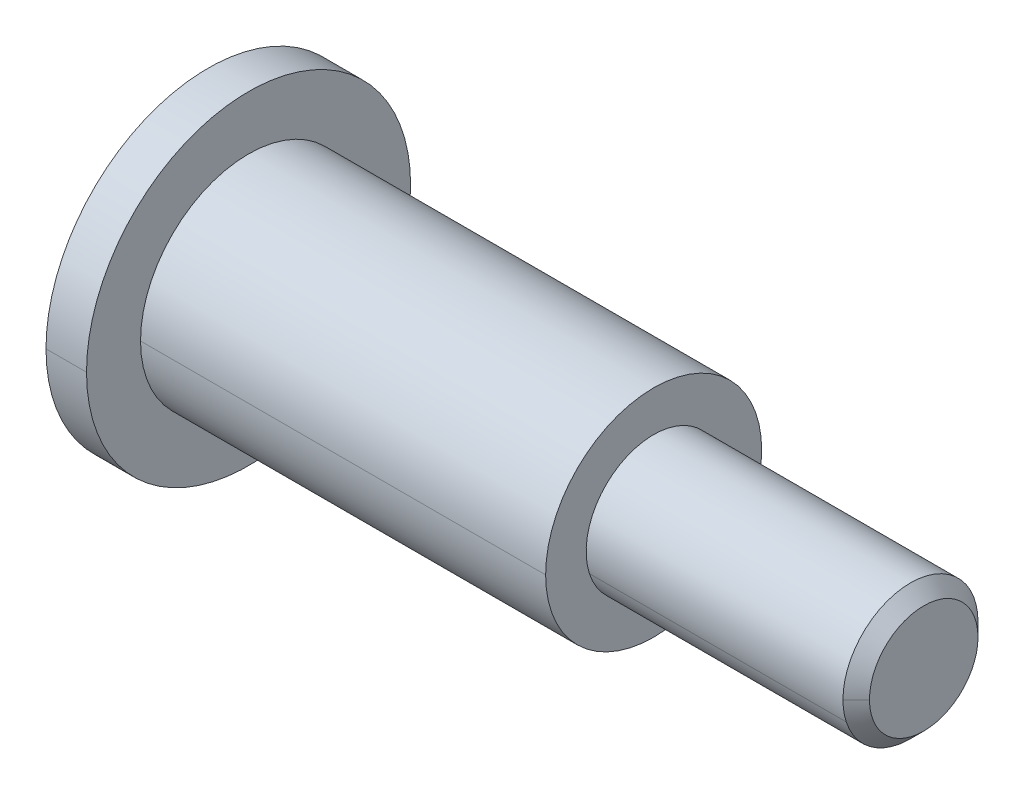
ISO-10303-21;
HEADER;
FILE_DESCRIPTION(('STEP AP214'),'2;1');
FILE_NAME('part.step','',(''),(''),'','','');
FILE_SCHEMA(('AUTOMOTIVE_DESIGN { 1 0 10303 214 1 1 1 1 }'));
ENDSEC;
DATA;
#1=APPLICATION_CONTEXT('core data for automotive mechanical design processes');
#2=APPLICATION_PROTOCOL_DEFINITION('international standard','automotive_design',2000,#1);
#3=PRODUCT_CONTEXT('',#1,'mechanical');
#4=PRODUCT('Part','Part','',(#3));
#5=PRODUCT_RELATED_PRODUCT_CATEGORY('part','',(#4));
#6=PRODUCT_DEFINITION_FORMATION('','',#4);
#7=PRODUCT_DEFINITION_CONTEXT('part definition',#1,'design');
#8=PRODUCT_DEFINITION('design','',#6,#7);
#9=PRODUCT_DEFINITION_SHAPE('','',#8);
#10=(LENGTH_UNIT() NAMED_UNIT(*) SI_UNIT(.MILLI.,.METRE.));
#11=(NAMED_UNIT(*) PLANE_ANGLE_UNIT() SI_UNIT($,.RADIAN.));
#12=(NAMED_UNIT(*) SI_UNIT($,.STERADIAN.) SOLID_ANGLE_UNIT());
#13=UNCERTAINTY_MEASURE_WITH_UNIT(LENGTH_MEASURE(1.E-05),#10,'distance_accuracy_value','');
#14=(GEOMETRIC_REPRESENTATION_CONTEXT(3) GLOBAL_UNCERTAINTY_ASSIGNED_CONTEXT((#13)) GLOBAL_UNIT_ASSIGNED_CONTEXT((#10,
#11,#12)) REPRESENTATION_CONTEXT('',''));
#15=CARTESIAN_POINT('',(0.,0.,0.));
#16=DIRECTION('',(0.,0.,1.));
#17=DIRECTION('',(1.,0.,0.));
#18=AXIS2_PLACEMENT_3D('',#15,#16,#17);
#19=CARTESIAN_POINT('',(-1.5,0.,0.));
#20=DIRECTION('',(1.,0.,0.));
#21=DIRECTION('',(0.,0.,-1.));
#22=AXIS2_PLACEMENT_3D('',#19,#20,#21);
#23=PLANE('',#22);
#24=CARTESIAN_POINT('',(-1.5,0.,0.));
#25=DIRECTION('',(1.,0.,0.));
#26=DIRECTION('',(0.,0.,-1.));
#27=AXIS2_PLACEMENT_3D('',#24,#25,#26);
#28=CIRCLE('',#27,6.);
#29=CARTESIAN_POINT('',(-1.5,0.,6.));
#30=VERTEX_POINT('',#29);
#31=CARTESIAN_POINT('',(-1.5,0.,-6.));
#32=VERTEX_POINT('',#31);
#33=EDGE_CURVE('E10',#30,#32,#28,.T.);
#34=ORIENTED_EDGE('',*,*,#33,.F.);
#35=CARTESIAN_POINT('',(-1.5,0.,0.));
#36=DIRECTION('',(1.,0.,0.));
#37=DIRECTION('',(0.,0.,-1.));
#38=AXIS2_PLACEMENT_3D('',#35,#36,#37);
#39=CIRCLE('',#38,6.);
#40=EDGE_CURVE('E23',#32,#30,#39,.T.);
#41=ORIENTED_EDGE('',*,*,#40,.F.);
#42=EDGE_LOOP('',(#34,#41));
#43=FACE_BOUND('',#42,.T.);
#44=DIRECTION('',(0.,0.500000000000009,-0.866025403784433));
#45=VECTOR('',#44,1.);
#46=CARTESIAN_POINT('',(-1.5,-1.7320508075689,0.));
#47=LINE('',#46,#45);
#48=CARTESIAN_POINT('',(-1.5,-1.7320508075689,0.));
#49=VERTEX_POINT('',#48);
#50=CARTESIAN_POINT('',(-1.5,-0.86602540378444,-1.5));
#51=VERTEX_POINT('',#50);
#52=EDGE_CURVE('E375',#49,#51,#47,.T.);
#53=ORIENTED_EDGE('',*,*,#52,.T.);
#54=DIRECTION('',(0.,1.,0.));
#55=VECTOR('',#54,1.);
#56=CARTESIAN_POINT('',(-1.5,-0.86602540378444,-1.5));
#57=LINE('',#56,#55);
#58=CARTESIAN_POINT('',(-1.5,0.86602540378444,-1.5));
#59=VERTEX_POINT('',#58);
#60=EDGE_CURVE('E371',#51,#59,#57,.T.);
#61=ORIENTED_EDGE('',*,*,#60,.T.);
#62=DIRECTION('',(0.,0.500000000000009,0.866025403784433));
#63=VECTOR('',#62,1.);
#64=CARTESIAN_POINT('',(-1.5,0.86602540378444,-1.5));
#65=LINE('',#64,#63);
#66=CARTESIAN_POINT('',(-1.5,1.7320508075689,0.));
#67=VERTEX_POINT('',#66);
#68=EDGE_CURVE('E367',#59,#67,#65,.T.);
#69=ORIENTED_EDGE('',*,*,#68,.T.);
#70=DIRECTION('',(0.,-0.500000000000009,0.866025403784433));
#71=VECTOR('',#70,1.);
#72=CARTESIAN_POINT('',(-1.5,1.7320508075689,0.));
#73=LINE('',#72,#71);
#74=CARTESIAN_POINT('',(-1.5,0.86602540378444,1.5));
#75=VERTEX_POINT('',#74);
#76=EDGE_CURVE('E363',#67,#75,#73,.T.);
#77=ORIENTED_EDGE('',*,*,#76,.T.);
#78=DIRECTION('',(0.,-1.,0.));
#79=VECTOR('',#78,1.);
#80=CARTESIAN_POINT('',(-1.5,0.86602540378444,1.5));
#81=LINE('',#80,#79);
#82=CARTESIAN_POINT('',(-1.5,-0.86602540378444,1.5));
#83=VERTEX_POINT('',#82);
#84=EDGE_CURVE('E359',#75,#83,#81,.T.);
#85=ORIENTED_EDGE('',*,*,#84,.T.);
#86=DIRECTION('',(0.,-0.500000000000009,-0.866025403784433));
#87=VECTOR('',#86,1.);
#88=CARTESIAN_POINT('',(-1.5,-0.86602540378444,1.5));
#89=LINE('',#88,#87);
#90=EDGE_CURVE('E355',#83,#49,#89,.T.);
#91=ORIENTED_EDGE('',*,*,#90,.T.);
#92=EDGE_LOOP('',(#53,#61,#69,#77,#85,#91));
#93=FACE_BOUND('',#92,.T.);
#94=ADVANCED_FACE('F15',(#43,#93),#23,.F.);
#95=CARTESIAN_POINT('',(1.5,-0.86602540378444,1.5));
#96=DIRECTION('',(0.,0.866025403784433,-0.500000000000009));
#97=DIRECTION('',(0.,0.500000000000009,0.866025403784433));
#98=AXIS2_PLACEMENT_3D('',#95,#96,#97);
#99=PLANE('',#98);
#100=ORIENTED_EDGE('',*,*,#90,.F.);
#101=DIRECTION('',(-1.,0.,0.));
#102=VECTOR('',#101,1.);
#103=CARTESIAN_POINT('',(1.5,-0.86602540378444,1.5));
#104=LINE('',#103,#102);
#105=CARTESIAN_POINT('',(1.5,-0.86602540378444,1.5));
#106=VERTEX_POINT('',#105);
#107=EDGE_CURVE('E350',#106,#83,#104,.T.);
#108=ORIENTED_EDGE('',*,*,#107,.F.);
#109=DIRECTION('',(0.,-0.500000000000009,-0.866025403784433));
#110=VECTOR('',#109,1.);
#111=CARTESIAN_POINT('',(1.5,-0.86602540378444,1.5));
#112=LINE('',#111,#110);
#113=CARTESIAN_POINT('',(1.5,-1.29903810567666,0.750000000000019));
#114=VERTEX_POINT('',#113);
#115=EDGE_CURVE('E346',#106,#114,#112,.T.);
#116=ORIENTED_EDGE('',*,*,#115,.T.);
#117=DIRECTION('',(0.,-0.500000000000009,-0.866025403784433));
#118=VECTOR('',#117,1.);
#119=CARTESIAN_POINT('',(1.5,-0.86602540378444,1.5));
#120=LINE('',#119,#118);
#121=CARTESIAN_POINT('',(1.5,-1.7320508075689,0.));
#122=VERTEX_POINT('',#121);
#123=EDGE_CURVE('E342',#114,#122,#120,.T.);
#124=ORIENTED_EDGE('',*,*,#123,.T.);
#125=DIRECTION('',(-1.,0.,0.));
#126=VECTOR('',#125,1.);
#127=CARTESIAN_POINT('',(1.5,-1.7320508075689,0.));
#128=LINE('',#127,#126);
#129=EDGE_CURVE('E337',#122,#49,#128,.T.);
#130=ORIENTED_EDGE('',*,*,#129,.T.);
#131=EDGE_LOOP('',(#100,#108,#116,#124,#130));
#132=FACE_BOUND('',#131,.T.);
#133=ADVANCED_FACE('F404',(#132),#99,.T.);
#134=CARTESIAN_POINT('',(1.5,-1.7320508075689,0.));
#135=DIRECTION('',(0.,0.866025403784433,0.500000000000009));
#136=DIRECTION('',(0.,-0.500000000000009,0.866025403784433));
#137=AXIS2_PLACEMENT_3D('',#134,#135,#136);
#138=PLANE('',#137);
#139=ORIENTED_EDGE('',*,*,#52,.F.);
#140=ORIENTED_EDGE('',*,*,#129,.F.);
#141=DIRECTION('',(0.,0.500000000000009,-0.866025403784433));
#142=VECTOR('',#141,1.);
#143=CARTESIAN_POINT('',(1.5,-1.7320508075689,0.));
#144=LINE('',#143,#142);
#145=CARTESIAN_POINT('',(1.5,-1.29903810567665,-0.750000000000014));
#146=VERTEX_POINT('',#145);
#147=EDGE_CURVE('E333',#122,#146,#144,.T.);
#148=ORIENTED_EDGE('',*,*,#147,.T.);
#149=DIRECTION('',(0.,0.500000000000009,-0.866025403784433));
#150=VECTOR('',#149,1.);
#151=CARTESIAN_POINT('',(1.5,-1.7320508075689,0.));
#152=LINE('',#151,#150);
#153=CARTESIAN_POINT('',(1.5,-0.86602540378444,-1.5));
#154=VERTEX_POINT('',#153);
#155=EDGE_CURVE('E329',#146,#154,#152,.T.);
#156=ORIENTED_EDGE('',*,*,#155,.T.);
#157=DIRECTION('',(-1.,0.,0.));
#158=VECTOR('',#157,1.);
#159=CARTESIAN_POINT('',(1.5,-0.86602540378444,-1.5));
#160=LINE('',#159,#158);
#161=EDGE_CURVE('E324',#154,#51,#160,.T.);
#162=ORIENTED_EDGE('',*,*,#161,.T.);
#163=EDGE_LOOP('',(#139,#140,#148,#156,#162));
#164=FACE_BOUND('',#163,.T.);
#165=ADVANCED_FACE('F408',(#164),#138,.T.);
#166=CARTESIAN_POINT('',(1.5,-0.86602540378444,-1.5));
#167=DIRECTION('',(0.,0.,1.));
#168=DIRECTION('',(1.,0.,0.));
#169=AXIS2_PLACEMENT_3D('',#166,#167,#168);
#170=PLANE('',#169);
#171=ORIENTED_EDGE('',*,*,#60,.F.);
#172=ORIENTED_EDGE('',*,*,#161,.F.);
#173=DIRECTION('',(0.,1.,0.));
#174=VECTOR('',#173,1.);
#175=CARTESIAN_POINT('',(1.5,-0.86602540378444,-1.5));
#176=LINE('',#175,#174);
#177=CARTESIAN_POINT('',(1.5,0.,-1.5));
#178=VERTEX_POINT('',#177);
#179=EDGE_CURVE('E320',#154,#178,#176,.T.);
#180=ORIENTED_EDGE('',*,*,#179,.T.);
#181=DIRECTION('',(0.,1.,0.));
#182=VECTOR('',#181,1.);
#183=CARTESIAN_POINT('',(1.5,-0.86602540378444,-1.5));
#184=LINE('',#183,#182);
#185=CARTESIAN_POINT('',(1.5,0.86602540378444,-1.5));
#186=VERTEX_POINT('',#185);
#187=EDGE_CURVE('E316',#178,#186,#184,.T.);
#188=ORIENTED_EDGE('',*,*,#187,.T.);
#189=DIRECTION('',(-1.,0.,0.));
#190=VECTOR('',#189,1.);
#191=CARTESIAN_POINT('',(1.5,0.86602540378444,-1.5));
#192=LINE('',#191,#190);
#193=EDGE_CURVE('E311',#186,#59,#192,.T.);
#194=ORIENTED_EDGE('',*,*,#193,.T.);
#195=EDGE_LOOP('',(#171,#172,#180,#188,#194));
#196=FACE_BOUND('',#195,.T.);
#197=ADVANCED_FACE('F420',(#196),#170,.T.);
#198=CARTESIAN_POINT('',(1.5,0.86602540378444,-1.5));
#199=DIRECTION('',(0.,-0.866025403784433,0.500000000000009));
#200=DIRECTION('',(0.,-0.500000000000009,-0.866025403784433));
#201=AXIS2_PLACEMENT_3D('',#198,#199,#200);
#202=PLANE('',#201);
#203=ORIENTED_EDGE('',*,*,#68,.F.);
#204=ORIENTED_EDGE('',*,*,#193,.F.);
#205=DIRECTION('',(0.,0.500000000000009,0.866025403784433));
#206=VECTOR('',#205,1.);
#207=CARTESIAN_POINT('',(1.5,0.86602540378444,-1.5));
#208=LINE('',#207,#206);
#209=CARTESIAN_POINT('',(1.5,1.29903810567666,-0.750000000000019));
#210=VERTEX_POINT('',#209);
#211=EDGE_CURVE('E307',#186,#210,#208,.T.);
#212=ORIENTED_EDGE('',*,*,#211,.T.);
#213=DIRECTION('',(0.,0.500000000000009,0.866025403784433));
#214=VECTOR('',#213,1.);
#215=CARTESIAN_POINT('',(1.5,0.86602540378444,-1.5));
#216=LINE('',#215,#214);
#217=CARTESIAN_POINT('',(1.5,1.7320508075689,0.));
#218=VERTEX_POINT('',#217);
#219=EDGE_CURVE('E303',#210,#218,#216,.T.);
#220=ORIENTED_EDGE('',*,*,#219,.T.);
#221=DIRECTION('',(-1.,0.,0.));
#222=VECTOR('',#221,1.);
#223=CARTESIAN_POINT('',(1.5,1.7320508075689,0.));
#224=LINE('',#223,#222);
#225=EDGE_CURVE('E298',#218,#67,#224,.T.);
#226=ORIENTED_EDGE('',*,*,#225,.T.);
#227=EDGE_LOOP('',(#203,#204,#212,#220,#226));
#228=FACE_BOUND('',#227,.T.);
#229=ADVANCED_FACE('F426',(#228),#202,.T.);
#230=CARTESIAN_POINT('',(1.5,1.7320508075689,0.));
#231=DIRECTION('',(0.,-0.866025403784433,-0.500000000000009));
#232=DIRECTION('',(0.,0.500000000000009,-0.866025403784433));
#233=AXIS2_PLACEMENT_3D('',#230,#231,#232);
#234=PLANE('',#233);
#235=ORIENTED_EDGE('',*,*,#76,.F.);
#236=ORIENTED_EDGE('',*,*,#225,.F.);
#237=DIRECTION('',(0.,-0.500000000000009,0.866025403784433));
#238=VECTOR('',#237,1.);
#239=CARTESIAN_POINT('',(1.5,1.7320508075689,0.));
#240=LINE('',#239,#238);
#241=CARTESIAN_POINT('',(1.5,1.29903810567666,0.750000000000019));
#242=VERTEX_POINT('',#241);
#243=EDGE_CURVE('E294',#218,#242,#240,.T.);
#244=ORIENTED_EDGE('',*,*,#243,.T.);
#245=DIRECTION('',(0.,-0.500000000000009,0.866025403784433));
#246=VECTOR('',#245,1.);
#247=CARTESIAN_POINT('',(1.5,1.7320508075689,0.));
#248=LINE('',#247,#246);
#249=CARTESIAN_POINT('',(1.5,0.86602540378444,1.5));
#250=VERTEX_POINT('',#249);
#251=EDGE_CURVE('E290',#242,#250,#248,.T.);
#252=ORIENTED_EDGE('',*,*,#251,.T.);
#253=DIRECTION('',(-1.,0.,0.));
#254=VECTOR('',#253,1.);
#255=CARTESIAN_POINT('',(1.5,0.86602540378444,1.5));
#256=LINE('',#255,#254);
#257=EDGE_CURVE('E285',#250,#75,#256,.T.);
#258=ORIENTED_EDGE('',*,*,#257,.T.);
#259=EDGE_LOOP('',(#235,#236,#244,#252,#258));
#260=FACE_BOUND('',#259,.T.);
#261=ADVANCED_FACE('F432',(#260),#234,.T.);
#262=CARTESIAN_POINT('',(1.5,0.86602540378444,1.5));
#263=DIRECTION('',(0.,0.,-1.));
#264=DIRECTION('',(-1.,0.,0.));
#265=AXIS2_PLACEMENT_3D('',#262,#263,#264);
#266=PLANE('',#265);
#267=ORIENTED_EDGE('',*,*,#84,.F.);
#268=ORIENTED_EDGE('',*,*,#257,.F.);
#269=DIRECTION('',(0.,-1.,0.));
#270=VECTOR('',#269,1.);
#271=CARTESIAN_POINT('',(1.5,0.86602540378444,1.5));
#272=LINE('',#271,#270);
#273=CARTESIAN_POINT('',(1.5,0.,1.5));
#274=VERTEX_POINT('',#273);
#275=EDGE_CURVE('E281',#250,#274,#272,.T.);
#276=ORIENTED_EDGE('',*,*,#275,.T.);
#277=DIRECTION('',(0.,-1.,0.));
#278=VECTOR('',#277,1.);
#279=CARTESIAN_POINT('',(1.5,0.86602540378444,1.5));
#280=LINE('',#279,#278);
#281=EDGE_CURVE('E276',#274,#106,#280,.T.);
#282=ORIENTED_EDGE('',*,*,#281,.T.);
#283=ORIENTED_EDGE('',*,*,#107,.T.);
#284=EDGE_LOOP('',(#267,#268,#276,#282,#283));
#285=FACE_BOUND('',#284,.T.);
#286=ADVANCED_FACE('F436',(#285),#266,.T.);
#287=CARTESIAN_POINT('',(1.5,0.,0.));
#288=DIRECTION('',(1.,0.,0.));
#289=DIRECTION('',(0.,0.,-1.));
#290=AXIS2_PLACEMENT_3D('',#287,#288,#289);
#291=PLANE('',#290);
#292=CARTESIAN_POINT('',(1.5,0.,0.));
#293=DIRECTION('',(1.,0.,0.));
#294=DIRECTION('',(0.,0.,-1.));
#295=AXIS2_PLACEMENT_3D('',#292,#293,#294);
#296=CIRCLE('',#295,1.5);
#297=EDGE_CURVE('E271',#274,#114,#296,.T.);
#298=ORIENTED_EDGE('',*,*,#297,.T.);
#299=ORIENTED_EDGE('',*,*,#115,.F.);
#300=ORIENTED_EDGE('',*,*,#281,.F.);
#301=EDGE_LOOP('',(#298,#299,#300));
#302=FACE_BOUND('',#301,.T.);
#303=ADVANCED_FACE('F477',(#302),#291,.F.);
#304=CARTESIAN_POINT('',(1.5,0.,0.));
#305=DIRECTION('',(-1.,0.,0.));
#306=DIRECTION('',(0.,1.,0.));
#307=AXIS2_PLACEMENT_3D('',#304,#305,#306);
#308=CONICAL_SURFACE('',#307,1.5,1.04719755119662);
#309=DIRECTION('',(-0.499999999999983,0.,-0.866025403784448));
#310=VECTOR('',#309,1.);
#311=CARTESIAN_POINT('',(2.3660254037844,0.,0.));
#312=LINE('',#311,#310);
#313=CARTESIAN_POINT('',(2.3660254037844,0.,0.));
#314=VERTEX_POINT('',#313);
#315=EDGE_CURVE('E266',#314,#178,#312,.T.);
#316=ORIENTED_EDGE('',*,*,#315,.T.);
#317=CARTESIAN_POINT('',(1.5,0.,0.));
#318=DIRECTION('',(1.,0.,0.));
#319=DIRECTION('',(0.,0.,-1.));
#320=AXIS2_PLACEMENT_3D('',#317,#318,#319);
#321=CIRCLE('',#320,1.5);
#322=EDGE_CURVE('E261',#146,#178,#321,.T.);
#323=ORIENTED_EDGE('',*,*,#322,.F.);
#324=CARTESIAN_POINT('',(1.5,0.,0.));
#325=DIRECTION('',(1.,0.,0.));
#326=DIRECTION('',(0.,0.,-1.));
#327=AXIS2_PLACEMENT_3D('',#324,#325,#326);
#328=CIRCLE('',#327,1.5);
#329=EDGE_CURVE('E256',#114,#146,#328,.T.);
#330=ORIENTED_EDGE('',*,*,#329,.F.);
#331=ORIENTED_EDGE('',*,*,#297,.F.);
#332=DIRECTION('',(-0.499999999999983,0.,0.866025403784448));
#333=VECTOR('',#332,1.);
#334=CARTESIAN_POINT('',(2.3660254037844,0.,0.));
#335=LINE('',#334,#333);
#336=EDGE_CURVE('E251',#314,#274,#335,.T.);
#337=ORIENTED_EDGE('',*,*,#336,.F.);
#338=EDGE_LOOP('',(#316,#323,#330,#331,#337));
#339=FACE_BOUND('',#338,.T.);
#340=ADVANCED_FACE('F445',(#339),#308,.F.);
#341=CARTESIAN_POINT('',(1.5,0.,0.));
#342=DIRECTION('',(-1.,0.,0.));
#343=DIRECTION('',(0.,-1.,0.));
#344=AXIS2_PLACEMENT_3D('',#341,#342,#343);
#345=CONICAL_SURFACE('',#344,1.5,1.04719755119662);
#346=ORIENTED_EDGE('',*,*,#336,.T.);
#347=CARTESIAN_POINT('',(1.5,0.,0.));
#348=DIRECTION('',(1.,0.,0.));
#349=DIRECTION('',(0.,0.,-1.));
#350=AXIS2_PLACEMENT_3D('',#347,#348,#349);
#351=CIRCLE('',#350,1.5);
#352=EDGE_CURVE('E246',#242,#274,#351,.T.);
#353=ORIENTED_EDGE('',*,*,#352,.F.);
#354=CARTESIAN_POINT('',(1.5,0.,0.));
#355=DIRECTION('',(1.,0.,0.));
#356=DIRECTION('',(0.,0.,-1.));
#357=AXIS2_PLACEMENT_3D('',#354,#355,#356);
#358=CIRCLE('',#357,1.5);
#359=EDGE_CURVE('E241',#210,#242,#358,.T.);
#360=ORIENTED_EDGE('',*,*,#359,.F.);
#361=CARTESIAN_POINT('',(1.5,0.,0.));
#362=DIRECTION('',(1.,0.,0.));
#363=DIRECTION('',(0.,0.,-1.));
#364=AXIS2_PLACEMENT_3D('',#361,#362,#363);
#365=CIRCLE('',#364,1.5);
#366=EDGE_CURVE('E236',#178,#210,#365,.T.);
#367=ORIENTED_EDGE('',*,*,#366,.F.);
#368=ORIENTED_EDGE('',*,*,#315,.F.);
#369=EDGE_LOOP('',(#346,#353,#360,#367,#368));
#370=FACE_BOUND('',#369,.T.);
#371=ADVANCED_FACE('F470',(#370),#345,.F.);
#372=CARTESIAN_POINT('',(1.5,0.,0.));
#373=DIRECTION('',(1.,0.,0.));
#374=DIRECTION('',(0.,0.,-1.));
#375=AXIS2_PLACEMENT_3D('',#372,#373,#374);
#376=PLANE('',#375);
#377=ORIENTED_EDGE('',*,*,#366,.T.);
#378=ORIENTED_EDGE('',*,*,#211,.F.);
#379=ORIENTED_EDGE('',*,*,#187,.F.);
#380=EDGE_LOOP('',(#377,#378,#379));
#381=FACE_BOUND('',#380,.T.);
#382=ADVANCED_FACE('F466',(#381),#376,.F.);
#383=CARTESIAN_POINT('',(1.5,0.,0.));
#384=DIRECTION('',(1.,0.,0.));
#385=DIRECTION('',(0.,0.,-1.));
#386=AXIS2_PLACEMENT_3D('',#383,#384,#385);
#387=PLANE('',#386);
#388=ORIENTED_EDGE('',*,*,#219,.F.);
#389=ORIENTED_EDGE('',*,*,#359,.T.);
#390=ORIENTED_EDGE('',*,*,#243,.F.);
#391=EDGE_LOOP('',(#388,#389,#390));
#392=FACE_BOUND('',#391,.T.);
#393=ADVANCED_FACE('F459',(#392),#387,.F.);
#394=CARTESIAN_POINT('',(1.5,0.,0.));
#395=DIRECTION('',(1.,0.,0.));
#396=DIRECTION('',(0.,0.,-1.));
#397=AXIS2_PLACEMENT_3D('',#394,#395,#396);
#398=PLANE('',#397);
#399=ORIENTED_EDGE('',*,*,#352,.T.);
#400=ORIENTED_EDGE('',*,*,#275,.F.);
#401=ORIENTED_EDGE('',*,*,#251,.F.);
#402=EDGE_LOOP('',(#399,#400,#401));
#403=FACE_BOUND('',#402,.T.);
#404=ADVANCED_FACE('F452',(#403),#398,.F.);
#405=CARTESIAN_POINT('',(1.5,0.,0.));
#406=DIRECTION('',(1.,0.,0.));
#407=DIRECTION('',(0.,0.,-1.));
#408=AXIS2_PLACEMENT_3D('',#405,#406,#407);
#409=PLANE('',#408);
#410=ORIENTED_EDGE('',*,*,#329,.T.);
#411=ORIENTED_EDGE('',*,*,#147,.F.);
#412=ORIENTED_EDGE('',*,*,#123,.F.);
#413=EDGE_LOOP('',(#410,#411,#412));
#414=FACE_BOUND('',#413,.T.);
#415=ADVANCED_FACE('F450',(#414),#409,.F.);
#416=CARTESIAN_POINT('',(1.5,0.,0.));
#417=DIRECTION('',(1.,0.,0.));
#418=DIRECTION('',(0.,0.,-1.));
#419=AXIS2_PLACEMENT_3D('',#416,#417,#418);
#420=PLANE('',#419);
#421=ORIENTED_EDGE('',*,*,#322,.T.);
#422=ORIENTED_EDGE('',*,*,#179,.F.);
#423=ORIENTED_EDGE('',*,*,#155,.F.);
#424=EDGE_LOOP('',(#421,#422,#423));
#425=FACE_BOUND('',#424,.T.);
#426=ADVANCED_FACE('F449',(#425),#420,.F.);
#427=CARTESIAN_POINT('',(15.,0.,0.));
#428=DIRECTION('',(1.,0.,0.));
#429=DIRECTION('',(0.,-1.,0.));
#430=AXIS2_PLACEMENT_3D('',#427,#428,#429);
#431=CYLINDRICAL_SURFACE('',#430,6.);
#432=DIRECTION('',(1.,0.,0.));
#433=VECTOR('',#432,1.);
#434=CARTESIAN_POINT('',(-1.5,0.,6.));
#435=LINE('',#434,#433);
#436=CARTESIAN_POINT('',(0.,0.,6.));
#437=VERTEX_POINT('',#436);
#438=EDGE_CURVE('E232',#30,#437,#435,.T.);
#439=ORIENTED_EDGE('',*,*,#438,.T.);
#440=CARTESIAN_POINT('',(0.,0.,0.));
#441=DIRECTION('',(1.,0.,0.));
#442=DIRECTION('',(0.,0.,-1.));
#443=AXIS2_PLACEMENT_3D('',#440,#441,#442);
#444=CIRCLE('',#443,6.);
#445=CARTESIAN_POINT('',(0.,0.,-6.));
#446=VERTEX_POINT('',#445);
#447=EDGE_CURVE('E227',#446,#437,#444,.T.);
#448=ORIENTED_EDGE('',*,*,#447,.F.);
#449=DIRECTION('',(1.,0.,0.));
#450=VECTOR('',#449,1.);
#451=CARTESIAN_POINT('',(-1.5,0.,-6.));
#452=LINE('',#451,#450);
#453=EDGE_CURVE('E222',#32,#446,#452,.T.);
#454=ORIENTED_EDGE('',*,*,#453,.F.);
#455=ORIENTED_EDGE('',*,*,#40,.T.);
#456=EDGE_LOOP('',(#439,#448,#454,#455));
#457=FACE_BOUND('',#456,.T.);
#458=ADVANCED_FACE('F384',(#457),#431,.T.);
#459=CARTESIAN_POINT('',(15.,0.,0.));
#460=DIRECTION('',(1.,0.,0.));
#461=DIRECTION('',(0.,1.,0.));
#462=AXIS2_PLACEMENT_3D('',#459,#460,#461);
#463=CYLINDRICAL_SURFACE('',#462,6.);
#464=ORIENTED_EDGE('',*,*,#438,.F.);
#465=ORIENTED_EDGE('',*,*,#33,.T.);
#466=ORIENTED_EDGE('',*,*,#453,.T.);
#467=CARTESIAN_POINT('',(0.,0.,0.));
#468=DIRECTION('',(1.,0.,0.));
#469=DIRECTION('',(0.,0.,-1.));
#470=AXIS2_PLACEMENT_3D('',#467,#468,#469);
#471=CIRCLE('',#470,6.);
#472=EDGE_CURVE('E217',#437,#446,#471,.T.);
#473=ORIENTED_EDGE('',*,*,#472,.F.);
#474=EDGE_LOOP('',(#464,#465,#466,#473));
#475=FACE_BOUND('',#474,.T.);
#476=ADVANCED_FACE('F387',(#475),#463,.T.);
#477=CARTESIAN_POINT('',(0.,6.,0.));
#478=DIRECTION('',(-1.,0.,0.));
#479=DIRECTION('',(0.,0.,1.));
#480=AXIS2_PLACEMENT_3D('',#477,#478,#479);
#481=PLANE('',#480);
#482=CARTESIAN_POINT('',(0.,0.,0.));
#483=DIRECTION('',(1.,0.,0.));
#484=DIRECTION('',(0.,0.,-1.));
#485=AXIS2_PLACEMENT_3D('',#482,#483,#484);
#486=CIRCLE('',#485,4.);
#487=CARTESIAN_POINT('',(0.,0.,4.));
#488=VERTEX_POINT('',#487);
#489=CARTESIAN_POINT('',(0.,0.,-4.));
#490=VERTEX_POINT('',#489);
#491=EDGE_CURVE('E212',#488,#490,#486,.T.);
#492=ORIENTED_EDGE('',*,*,#491,.F.);
#493=CARTESIAN_POINT('',(0.,0.,0.));
#494=DIRECTION('',(1.,0.,0.));
#495=DIRECTION('',(0.,0.,-1.));
#496=AXIS2_PLACEMENT_3D('',#493,#494,#495);
#497=CIRCLE('',#496,4.);
#498=EDGE_CURVE('E207',#490,#488,#497,.T.);
#499=ORIENTED_EDGE('',*,*,#498,.F.);
#500=EDGE_LOOP('',(#492,#499));
#501=FACE_BOUND('',#500,.T.);
#502=ORIENTED_EDGE('',*,*,#447,.T.);
#503=ORIENTED_EDGE('',*,*,#472,.T.);
#504=EDGE_LOOP('',(#502,#503));
#505=FACE_BOUND('',#504,.T.);
#506=ADVANCED_FACE('F389',(#501,#505),#481,.F.);
#507=CARTESIAN_POINT('',(15.,0.,0.));
#508=DIRECTION('',(1.,0.,0.));
#509=DIRECTION('',(0.,-1.,0.));
#510=AXIS2_PLACEMENT_3D('',#507,#508,#509);
#511=CYLINDRICAL_SURFACE('',#510,4.);
#512=DIRECTION('',(1.,0.,0.));
#513=VECTOR('',#512,1.);
#514=CARTESIAN_POINT('',(0.,0.,4.));
#515=LINE('',#514,#513);
#516=CARTESIAN_POINT('',(15.,0.,4.));
#517=VERTEX_POINT('',#516);
#518=EDGE_CURVE('E203',#488,#517,#515,.T.);
#519=ORIENTED_EDGE('',*,*,#518,.T.);
#520=CARTESIAN_POINT('',(15.,0.,0.));
#521=DIRECTION('',(1.,0.,0.));
#522=DIRECTION('',(0.,0.,-1.));
#523=AXIS2_PLACEMENT_3D('',#520,#521,#522);
#524=CIRCLE('',#523,4.);
#525=CARTESIAN_POINT('',(15.,0.,-4.));
#526=VERTEX_POINT('',#525);
#527=EDGE_CURVE('E198',#526,#517,#524,.T.);
#528=ORIENTED_EDGE('',*,*,#527,.F.);
#529=DIRECTION('',(1.,0.,0.));
#530=VECTOR('',#529,1.);
#531=CARTESIAN_POINT('',(0.,0.,-4.));
#532=LINE('',#531,#530);
#533=EDGE_CURVE('E193',#490,#526,#532,.T.);
#534=ORIENTED_EDGE('',*,*,#533,.F.);
#535=ORIENTED_EDGE('',*,*,#498,.T.);
#536=EDGE_LOOP('',(#519,#528,#534,#535));
#537=FACE_BOUND('',#536,.T.);
#538=ADVANCED_FACE('F391',(#537),#511,.T.);
#539=CARTESIAN_POINT('',(15.,0.,0.));
#540=DIRECTION('',(1.,0.,0.));
#541=DIRECTION('',(0.,1.,0.));
#542=AXIS2_PLACEMENT_3D('',#539,#540,#541);
#543=CYLINDRICAL_SURFACE('',#542,4.);
#544=ORIENTED_EDGE('',*,*,#518,.F.);
#545=ORIENTED_EDGE('',*,*,#491,.T.);
#546=ORIENTED_EDGE('',*,*,#533,.T.);
#547=CARTESIAN_POINT('',(15.,0.,0.));
#548=DIRECTION('',(1.,0.,0.));
#549=DIRECTION('',(0.,0.,-1.));
#550=AXIS2_PLACEMENT_3D('',#547,#548,#549);
#551=CIRCLE('',#550,4.);
#552=EDGE_CURVE('E188',#517,#526,#551,.T.);
#553=ORIENTED_EDGE('',*,*,#552,.F.);
#554=EDGE_LOOP('',(#544,#545,#546,#553));
#555=FACE_BOUND('',#554,.T.);
#556=ADVANCED_FACE('F399',(#555),#543,.T.);
#557=CARTESIAN_POINT('',(15.,4.,0.));
#558=DIRECTION('',(-1.,0.,0.));
#559=DIRECTION('',(0.,0.,1.));
#560=AXIS2_PLACEMENT_3D('',#557,#558,#559);
#561=PLANE('',#560);
#562=CARTESIAN_POINT('',(15.,0.,0.));
#563=DIRECTION('',(1.,0.,0.));
#564=DIRECTION('',(0.,0.,-1.));
#565=AXIS2_PLACEMENT_3D('',#562,#563,#564);
#566=CIRCLE('',#565,2.5);
#567=CARTESIAN_POINT('',(15.,-0.772542485937367,2.37764129073788));
#568=VERTEX_POINT('',#567);
#569=CARTESIAN_POINT('',(15.,0.,-2.5));
#570=VERTEX_POINT('',#569);
#571=EDGE_CURVE('E183',#568,#570,#566,.T.);
#572=ORIENTED_EDGE('',*,*,#571,.F.);
#573=CARTESIAN_POINT('',(15.,0.,0.));
#574=DIRECTION('',(1.,0.,0.));
#575=DIRECTION('',(0.,0.,-1.));
#576=AXIS2_PLACEMENT_3D('',#573,#574,#575);
#577=CIRCLE('',#576,2.5);
#578=EDGE_CURVE('E178',#570,#568,#577,.T.);
#579=ORIENTED_EDGE('',*,*,#578,.F.);
#580=EDGE_LOOP('',(#572,#579));
#581=FACE_BOUND('',#580,.T.);
#582=ORIENTED_EDGE('',*,*,#527,.T.);
#583=ORIENTED_EDGE('',*,*,#552,.T.);
#584=EDGE_LOOP('',(#582,#583));
#585=FACE_BOUND('',#584,.T.);
#586=ADVANCED_FACE('F581',(#581,#585),#561,.F.);
#587=CARTESIAN_POINT('',(25.,0.,0.));
#588=DIRECTION('',(1.,0.,0.));
#589=DIRECTION('',(0.,-0.987688340595138,-0.156434465040231));
#590=AXIS2_PLACEMENT_3D('',#587,#588,#589);
#591=CYLINDRICAL_SURFACE('',#590,2.5);
#592=DIRECTION('',(1.,0.,0.));
#593=VECTOR('',#592,1.);
#594=CARTESIAN_POINT('',(15.,-0.772542485937367,2.37764129073788));
#595=LINE('',#594,#593);
#596=CARTESIAN_POINT('',(24.5095,-0.772542485937367,2.37764129073788));
#597=VERTEX_POINT('',#596);
#598=EDGE_CURVE('E174',#568,#597,#595,.T.);
#599=ORIENTED_EDGE('',*,*,#598,.T.);
#600=CARTESIAN_POINT('',(24.5095,0.,0.));
#601=DIRECTION('',(1.,0.,0.));
#602=DIRECTION('',(0.,0.,-1.));
#603=AXIS2_PLACEMENT_3D('',#600,#601,#602);
#604=CIRCLE('',#603,2.5);
#605=CARTESIAN_POINT('',(24.5095,0.,2.5));
#606=VERTEX_POINT('',#605);
#607=EDGE_CURVE('E170',#606,#597,#604,.T.);
#608=ORIENTED_EDGE('',*,*,#607,.F.);
#609=CARTESIAN_POINT('',(24.5095,0.,0.));
#610=DIRECTION('',(1.,0.,0.));
#611=DIRECTION('',(0.,0.,-1.));
#612=AXIS2_PLACEMENT_3D('',#609,#610,#611);
#613=CIRCLE('',#612,2.5);
#614=CARTESIAN_POINT('',(24.5095,0.,-2.5));
#615=VERTEX_POINT('',#614);
#616=EDGE_CURVE('E148',#615,#606,#613,.T.);
#617=ORIENTED_EDGE('',*,*,#616,.F.);
#618=DIRECTION('',(1.,0.,0.));
#619=VECTOR('',#618,1.);
#620=CARTESIAN_POINT('',(15.,0.,-2.5));
#621=LINE('',#620,#619);
#622=EDGE_CURVE('E162',#570,#615,#621,.T.);
#623=ORIENTED_EDGE('',*,*,#622,.F.);
#624=ORIENTED_EDGE('',*,*,#578,.T.);
#625=EDGE_LOOP('',(#599,#608,#617,#623,#624));
#626=FACE_BOUND('',#625,.T.);
#627=ADVANCED_FACE('F591',(#626),#591,.T.);
#628=CARTESIAN_POINT('',(25.,0.,0.));
#629=DIRECTION('',(1.,0.,0.));
#630=DIRECTION('',(0.,0.987688340595138,0.156434465040231));
#631=AXIS2_PLACEMENT_3D('',#628,#629,#630);
#632=CYLINDRICAL_SURFACE('',#631,2.5);
#633=ORIENTED_EDGE('',*,*,#598,.F.);
#634=ORIENTED_EDGE('',*,*,#571,.T.);
#635=ORIENTED_EDGE('',*,*,#622,.T.);
#636=CARTESIAN_POINT('',(24.5095,0.,0.));
#637=DIRECTION('',(1.,0.,0.));
#638=DIRECTION('',(0.,0.,-1.));
#639=AXIS2_PLACEMENT_3D('',#636,#637,#638);
#640=CIRCLE('',#639,2.5);
#641=EDGE_CURVE('E158',#597,#615,#640,.T.);
#642=ORIENTED_EDGE('',*,*,#641,.F.);
#643=EDGE_LOOP('',(#633,#634,#635,#642));
#644=FACE_BOUND('',#643,.T.);
#645=ADVANCED_FACE('F601',(#644),#632,.T.);
#646=CARTESIAN_POINT('',(24.5095,0.,0.));
#647=DIRECTION('',(-1.,0.,0.));
#648=DIRECTION('',(0.,1.,0.));
#649=AXIS2_PLACEMENT_3D('',#646,#647,#648);
#650=CONICAL_SURFACE('',#649,2.5,0.785398163397447);
#651=DIRECTION('',(-0.707106781186548,0.,-0.707106781186547));
#652=VECTOR('',#651,1.);
#653=CARTESIAN_POINT('',(25.,0.,-2.0095));
#654=LINE('',#653,#652);
#655=CARTESIAN_POINT('',(25.,0.,-2.0095));
#656=VERTEX_POINT('',#655);
#657=EDGE_CURVE('E139',#656,#615,#654,.T.);
#658=ORIENTED_EDGE('',*,*,#657,.F.);
#659=CARTESIAN_POINT('',(25.,0.,0.));
#660=DIRECTION('',(1.,0.,0.));
#661=DIRECTION('',(0.,0.,-1.));
#662=AXIS2_PLACEMENT_3D('',#659,#660,#661);
#663=CIRCLE('',#662,2.0095);
#664=CARTESIAN_POINT('',(25.,0.,2.0095));
#665=VERTEX_POINT('',#664);
#666=EDGE_CURVE('E130',#665,#656,#663,.T.);
#667=ORIENTED_EDGE('',*,*,#666,.F.);
#668=DIRECTION('',(-0.707106781186548,0.,0.707106781186547));
#669=VECTOR('',#668,1.);
#670=CARTESIAN_POINT('',(25.,0.,2.0095));
#671=LINE('',#670,#669);
#672=EDGE_CURVE('E135',#665,#606,#671,.T.);
#673=ORIENTED_EDGE('',*,*,#672,.T.);
#674=ORIENTED_EDGE('',*,*,#607,.T.);
#675=ORIENTED_EDGE('',*,*,#641,.T.);
#676=EDGE_LOOP('',(#658,#667,#673,#674,#675));
#677=FACE_BOUND('',#676,.T.);
#678=ADVANCED_FACE('F132',(#677),#650,.T.);
#679=CARTESIAN_POINT('',(24.5095,0.,0.));
#680=DIRECTION('',(-1.,0.,0.));
#681=DIRECTION('',(0.,-1.,0.));
#682=AXIS2_PLACEMENT_3D('',#679,#680,#681);
#683=CONICAL_SURFACE('',#682,2.5,0.785398163397447);
#684=ORIENTED_EDGE('',*,*,#657,.T.);
#685=ORIENTED_EDGE('',*,*,#616,.T.);
#686=ORIENTED_EDGE('',*,*,#672,.F.);
#687=CARTESIAN_POINT('',(25.,0.,0.));
#688=DIRECTION('',(1.,0.,0.));
#689=DIRECTION('',(0.,0.,-1.));
#690=AXIS2_PLACEMENT_3D('',#687,#688,#689);
#691=CIRCLE('',#690,2.0095);
#692=EDGE_CURVE('E143',#656,#665,#691,.T.);
#693=ORIENTED_EDGE('',*,*,#692,.F.);
#694=EDGE_LOOP('',(#684,#685,#686,#693));
#695=FACE_BOUND('',#694,.T.);
#696=ADVANCED_FACE('F147',(#695),#683,.T.);
#697=CARTESIAN_POINT('',(25.,2.0095,0.));
#698=DIRECTION('',(-1.,0.,0.));
#699=DIRECTION('',(0.,0.,1.));
#700=AXIS2_PLACEMENT_3D('',#697,#698,#699);
#701=PLANE('',#700);
#702=ORIENTED_EDGE('',*,*,#692,.T.);
#703=ORIENTED_EDGE('',*,*,#666,.T.);
#704=EDGE_LOOP('',(#702,#703));
#705=FACE_BOUND('',#704,.T.);
#706=ADVANCED_FACE('F144',(#705),#701,.F.);
#707=CLOSED_SHELL('',(#94,#133,#165,#197,#229,#261,#286,#303,#340,#371,#382,#393,#404,#415,#426,
#458,#476,#506,#538,#556,#586,#627,#645,#678,#696,#706));
#708=MANIFOLD_SOLID_BREP('B1',#707);
#709=ADVANCED_BREP_SHAPE_REPRESENTATION('',(#18,#708),#14);
#710=SHAPE_DEFINITION_REPRESENTATION(#9,#709);
ENDSEC;
END-ISO-10303-21;
